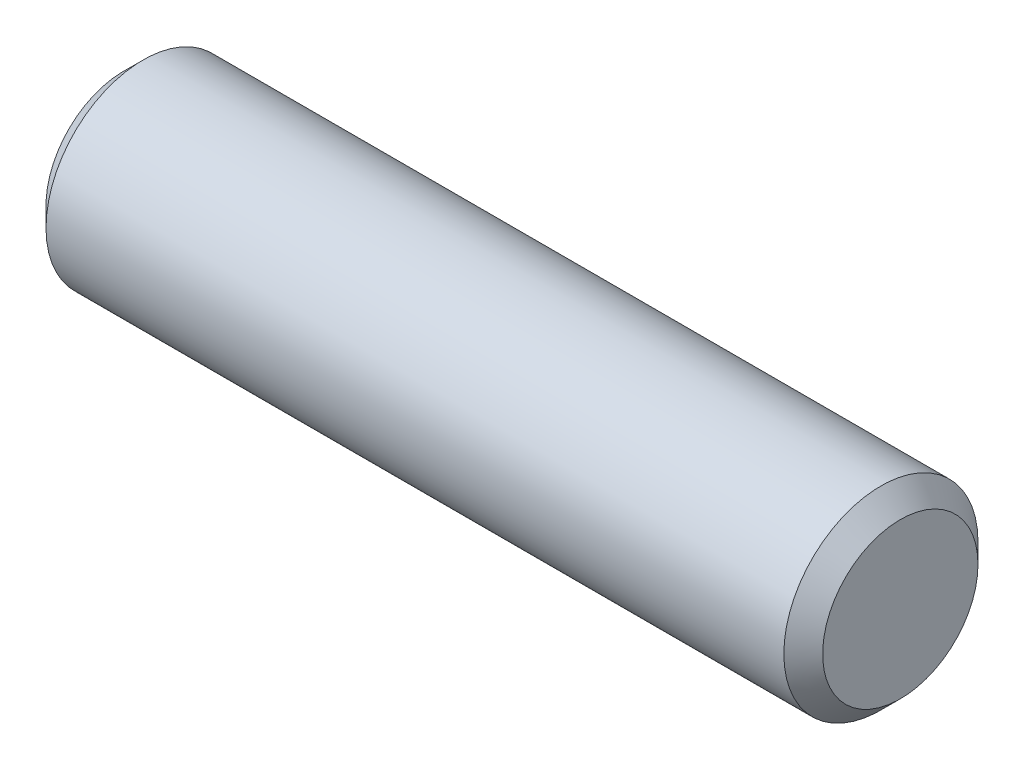
ISO-10303-21;
HEADER;
FILE_DESCRIPTION(('STEP AP214'),'2;1');
FILE_NAME('part.step','',(''),(''),'','','');
FILE_SCHEMA(('AUTOMOTIVE_DESIGN { 1 0 10303 214 1 1 1 1 }'));
ENDSEC;
DATA;
#1=APPLICATION_CONTEXT('core data for automotive mechanical design processes');
#2=APPLICATION_PROTOCOL_DEFINITION('international standard','automotive_design',2000,#1);
#3=PRODUCT_CONTEXT('',#1,'mechanical');
#4=PRODUCT('Part','Part','',(#3));
#5=PRODUCT_RELATED_PRODUCT_CATEGORY('part','',(#4));
#6=PRODUCT_DEFINITION_FORMATION('','',#4);
#7=PRODUCT_DEFINITION_CONTEXT('part definition',#1,'design');
#8=PRODUCT_DEFINITION('design','',#6,#7);
#9=PRODUCT_DEFINITION_SHAPE('','',#8);
#10=(LENGTH_UNIT() NAMED_UNIT(*) SI_UNIT(.MILLI.,.METRE.));
#11=(NAMED_UNIT(*) PLANE_ANGLE_UNIT() SI_UNIT($,.RADIAN.));
#12=(NAMED_UNIT(*) SI_UNIT($,.STERADIAN.) SOLID_ANGLE_UNIT());
#13=UNCERTAINTY_MEASURE_WITH_UNIT(LENGTH_MEASURE(1.E-05),#10,'distance_accuracy_value','');
#14=(GEOMETRIC_REPRESENTATION_CONTEXT(3) GLOBAL_UNCERTAINTY_ASSIGNED_CONTEXT((#13)) GLOBAL_UNIT_ASSIGNED_CONTEXT((#10,
#11,#12)) REPRESENTATION_CONTEXT('',''));
#15=CARTESIAN_POINT('',(0.,0.,0.));
#16=DIRECTION('',(0.,0.,1.));
#17=DIRECTION('',(1.,0.,0.));
#18=AXIS2_PLACEMENT_3D('',#15,#16,#17);
#19=CARTESIAN_POINT('',(-6.35,0.,0.));
#20=DIRECTION('',(1.,0.,0.));
#21=DIRECTION('',(0.,0.,-1.));
#22=AXIS2_PLACEMENT_3D('',#19,#20,#21);
#23=CYLINDRICAL_SURFACE('',#22,1.5875);
#24=CARTESIAN_POINT('',(6.0325,0.,0.));
#25=DIRECTION('',(1.,0.,0.));
#26=DIRECTION('',(0.,0.,-1.));
#27=AXIS2_PLACEMENT_3D('',#24,#25,#26);
#28=CIRCLE('',#27,1.5875);
#29=CARTESIAN_POINT('',(6.0325,0.,-1.5875));
#30=VERTEX_POINT('',#29);
#31=EDGE_CURVE('E37',#30,#30,#28,.F.);
#32=ORIENTED_EDGE('',*,*,#31,.T.);
#33=EDGE_LOOP('',(#32));
#34=FACE_BOUND('',#33,.T.);
#35=CARTESIAN_POINT('',(-6.0325,0.,0.));
#36=DIRECTION('',(1.,0.,0.));
#37=DIRECTION('',(0.,0.,-1.));
#38=AXIS2_PLACEMENT_3D('',#35,#36,#37);
#39=CIRCLE('',#38,1.5875);
#40=CARTESIAN_POINT('',(-6.0325,0.,-1.5875));
#41=VERTEX_POINT('',#40);
#42=EDGE_CURVE('E41',#41,#41,#39,.T.);
#43=ORIENTED_EDGE('',*,*,#42,.T.);
#44=EDGE_LOOP('',(#43));
#45=FACE_BOUND('',#44,.T.);
#46=ADVANCED_FACE('F30',(#34,#45),#23,.T.);
#47=CARTESIAN_POINT('',(-6.35,0.,0.));
#48=DIRECTION('',(1.,0.,0.));
#49=DIRECTION('',(0.,0.,-1.));
#50=AXIS2_PLACEMENT_3D('',#47,#48,#49);
#51=PLANE('',#50);
#52=CARTESIAN_POINT('',(-6.35,0.,0.));
#53=DIRECTION('',(1.,0.,0.));
#54=DIRECTION('',(0.,0.,-1.));
#55=AXIS2_PLACEMENT_3D('',#52,#53,#54);
#56=CIRCLE('',#55,1.27);
#57=CARTESIAN_POINT('',(-6.35,0.,-1.27));
#58=VERTEX_POINT('',#57);
#59=EDGE_CURVE('E10',#58,#58,#56,.F.);
#60=ORIENTED_EDGE('',*,*,#59,.T.);
#61=EDGE_LOOP('',(#60));
#62=FACE_BOUND('',#61,.T.);
#63=ADVANCED_FACE('F61',(#62),#51,.F.);
#64=CARTESIAN_POINT('',(6.35,0.,0.));
#65=DIRECTION('',(1.,0.,0.));
#66=DIRECTION('',(0.,0.,-1.));
#67=AXIS2_PLACEMENT_3D('',#64,#65,#66);
#68=PLANE('',#67);
#69=CARTESIAN_POINT('',(6.35,0.,0.));
#70=DIRECTION('',(1.,0.,0.));
#71=DIRECTION('',(0.,0.,-1.));
#72=AXIS2_PLACEMENT_3D('',#69,#70,#71);
#73=CIRCLE('',#72,1.27);
#74=CARTESIAN_POINT('',(6.35,0.,-1.27));
#75=VERTEX_POINT('',#74);
#76=EDGE_CURVE('E45',#75,#75,#73,.T.);
#77=ORIENTED_EDGE('',*,*,#76,.T.);
#78=EDGE_LOOP('',(#77));
#79=FACE_BOUND('',#78,.T.);
#80=ADVANCED_FACE('F51',(#79),#68,.T.);
#81=CARTESIAN_POINT('',(6.35,0.,0.));
#82=DIRECTION('',(-1.,0.,0.));
#83=DIRECTION('',(0.,0.,1.));
#84=AXIS2_PLACEMENT_3D('',#81,#82,#83);
#85=CONICAL_SURFACE('',#84,1.27,0.785398163397445);
#86=ORIENTED_EDGE('',*,*,#31,.F.);
#87=EDGE_LOOP('',(#86));
#88=FACE_BOUND('',#87,.T.);
#89=ORIENTED_EDGE('',*,*,#76,.F.);
#90=EDGE_LOOP('',(#89));
#91=FACE_BOUND('',#90,.T.);
#92=ADVANCED_FACE('F53',(#88,#91),#85,.T.);
#93=CARTESIAN_POINT('',(-6.0325,0.,0.));
#94=DIRECTION('',(1.,0.,0.));
#95=DIRECTION('',(0.,0.,-1.));
#96=AXIS2_PLACEMENT_3D('',#93,#94,#95);
#97=CONICAL_SURFACE('',#96,1.5875,0.785398163397448);
#98=ORIENTED_EDGE('',*,*,#59,.F.);
#99=EDGE_LOOP('',(#98));
#100=FACE_BOUND('',#99,.T.);
#101=ORIENTED_EDGE('',*,*,#42,.F.);
#102=EDGE_LOOP('',(#101));
#103=FACE_BOUND('',#102,.T.);
#104=ADVANCED_FACE('F32',(#100,#103),#97,.T.);
#105=CLOSED_SHELL('',(#46,#63,#80,#92,#104));
#106=MANIFOLD_SOLID_BREP('B2',#105);
#107=ADVANCED_BREP_SHAPE_REPRESENTATION('',(#18,#106),#14);
#108=SHAPE_DEFINITION_REPRESENTATION(#9,#107);
ENDSEC;
END-ISO-10303-21;
